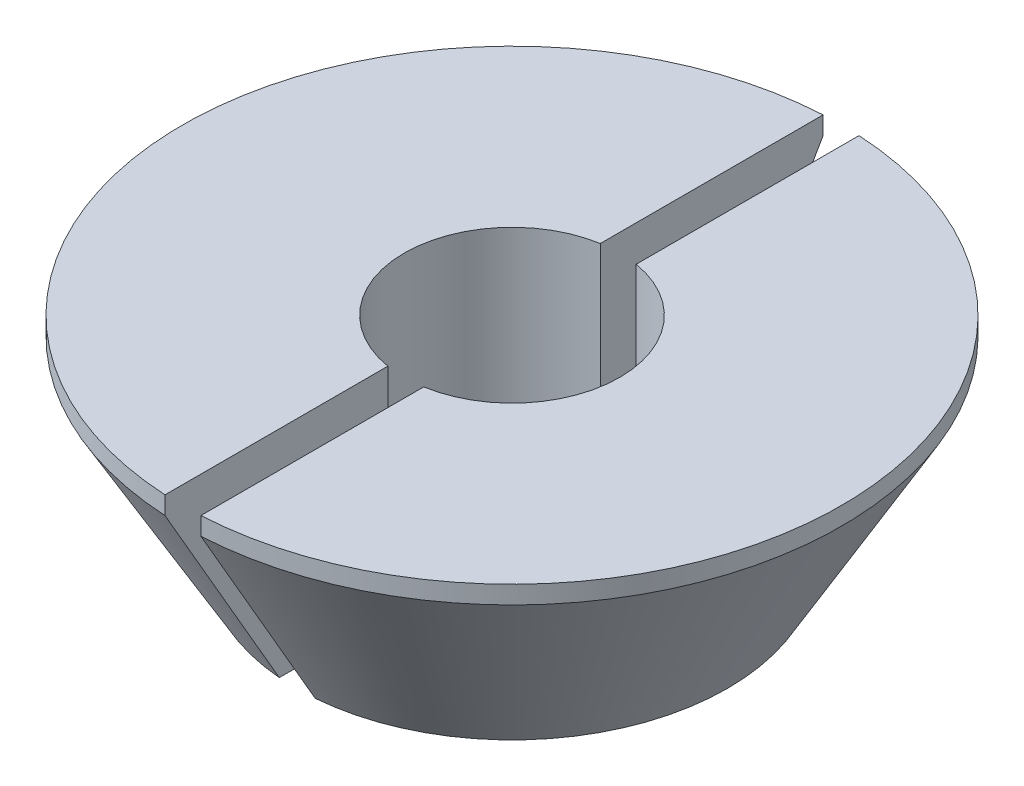
ISO-10303-21;
HEADER;
FILE_DESCRIPTION(('STEP AP214'),'2;1');
FILE_NAME('part.step','',(''),(''),'','','');
FILE_SCHEMA(('AUTOMOTIVE_DESIGN { 1 0 10303 214 1 1 1 1 }'));
ENDSEC;
DATA;
#1=APPLICATION_CONTEXT('core data for automotive mechanical design processes');
#2=APPLICATION_PROTOCOL_DEFINITION('international standard','automotive_design',2000,#1);
#3=PRODUCT_CONTEXT('',#1,'mechanical');
#4=PRODUCT('Part','Part','',(#3));
#5=PRODUCT_RELATED_PRODUCT_CATEGORY('part','',(#4));
#6=PRODUCT_DEFINITION_FORMATION('','',#4);
#7=PRODUCT_DEFINITION_CONTEXT('part definition',#1,'design');
#8=PRODUCT_DEFINITION('design','',#6,#7);
#9=PRODUCT_DEFINITION_SHAPE('','',#8);
#10=(LENGTH_UNIT() NAMED_UNIT(*) SI_UNIT(.MILLI.,.METRE.));
#11=(NAMED_UNIT(*) PLANE_ANGLE_UNIT() SI_UNIT($,.RADIAN.));
#12=(NAMED_UNIT(*) SI_UNIT($,.STERADIAN.) SOLID_ANGLE_UNIT());
#13=UNCERTAINTY_MEASURE_WITH_UNIT(LENGTH_MEASURE(1.E-05),#10,'distance_accuracy_value','');
#14=(GEOMETRIC_REPRESENTATION_CONTEXT(3) GLOBAL_UNCERTAINTY_ASSIGNED_CONTEXT((#13)) GLOBAL_UNIT_ASSIGNED_CONTEXT((#10,
#11,#12)) REPRESENTATION_CONTEXT('',''));
#15=CARTESIAN_POINT('',(0.,0.,0.));
#16=DIRECTION('',(0.,0.,1.));
#17=DIRECTION('',(1.,0.,0.));
#18=AXIS2_PLACEMENT_3D('',#15,#16,#17);
#19=CARTESIAN_POINT('',(0.,0.,0.));
#20=DIRECTION('',(0.,-1.,0.));
#21=DIRECTION('',(0.,0.,-1.));
#22=AXIS2_PLACEMENT_3D('',#19,#20,#21);
#23=CYLINDRICAL_SURFACE('',#22,1.5);
#24=DIRECTION('',(0.,-1.,0.));
#25=VECTOR('',#24,1.);
#26=CARTESIAN_POINT('',(-0.25,0.,-1.4790199457749));
#27=LINE('',#26,#25);
#28=CARTESIAN_POINT('',(-0.25,3.,-1.4790199457749));
#29=VERTEX_POINT('',#28);
#30=CARTESIAN_POINT('',(-0.25,0.,-1.4790199457749));
#31=VERTEX_POINT('',#30);
#32=EDGE_CURVE('E137',#29,#31,#27,.T.);
#33=ORIENTED_EDGE('',*,*,#32,.F.);
#34=CARTESIAN_POINT('',(0.,3.,0.));
#35=DIRECTION('',(0.,-1.,0.));
#36=DIRECTION('',(0.,0.,-1.));
#37=AXIS2_PLACEMENT_3D('',#34,#35,#36);
#38=CIRCLE('',#37,1.5);
#39=CARTESIAN_POINT('',(-0.25,3.,1.4790199457749));
#40=VERTEX_POINT('',#39);
#41=EDGE_CURVE('E58',#40,#29,#38,.T.);
#42=ORIENTED_EDGE('',*,*,#41,.F.);
#43=DIRECTION('',(0.,-1.,0.));
#44=VECTOR('',#43,1.);
#45=CARTESIAN_POINT('',(-0.25,0.,1.4790199457749));
#46=LINE('',#45,#44);
#47=CARTESIAN_POINT('',(-0.25,0.,1.4790199457749));
#48=VERTEX_POINT('',#47);
#49=EDGE_CURVE('E103',#48,#40,#46,.F.);
#50=ORIENTED_EDGE('',*,*,#49,.F.);
#51=CARTESIAN_POINT('',(0.,0.,0.));
#52=DIRECTION('',(0.,-1.,0.));
#53=DIRECTION('',(0.,0.,-1.));
#54=AXIS2_PLACEMENT_3D('',#51,#52,#53);
#55=CIRCLE('',#54,1.5);
#56=EDGE_CURVE('E125',#48,#31,#55,.T.);
#57=ORIENTED_EDGE('',*,*,#56,.T.);
#58=EDGE_LOOP('',(#33,#42,#50,#57));
#59=FACE_BOUND('',#58,.T.);
#60=ADVANCED_FACE('F55',(#59),#23,.F.);
#61=CARTESIAN_POINT('',(1.5,0.,0.));
#62=DIRECTION('',(0.,-1.,0.));
#63=DIRECTION('',(0.,0.,-1.));
#64=AXIS2_PLACEMENT_3D('',#61,#62,#63);
#65=PLANE('',#64);
#66=DIRECTION('',(0.,0.,1.));
#67=VECTOR('',#66,1.);
#68=CARTESIAN_POINT('',(-0.25,0.,5.));
#69=LINE('',#68,#67);
#70=CARTESIAN_POINT('',(-0.25,0.,2.98956518577535));
#71=VERTEX_POINT('',#70);
#72=EDGE_CURVE('E124',#48,#71,#69,.T.);
#73=ORIENTED_EDGE('',*,*,#72,.T.);
#74=CARTESIAN_POINT('',(0.,0.,0.));
#75=DIRECTION('',(0.,-1.,0.));
#76=DIRECTION('',(0.,0.,-1.));
#77=AXIS2_PLACEMENT_3D('',#74,#75,#76);
#78=CIRCLE('',#77,3.);
#79=CARTESIAN_POINT('',(-0.25,0.,-2.98956518577535));
#80=VERTEX_POINT('',#79);
#81=EDGE_CURVE('E121',#71,#80,#78,.T.);
#82=ORIENTED_EDGE('',*,*,#81,.T.);
#83=EDGE_CURVE('E118',#80,#31,#69,.T.);
#84=ORIENTED_EDGE('',*,*,#83,.T.);
#85=ORIENTED_EDGE('',*,*,#56,.F.);
#86=EDGE_LOOP('',(#73,#82,#84,#85));
#87=FACE_BOUND('',#86,.T.);
#88=ADVANCED_FACE('F152',(#87),#65,.T.);
#89=CARTESIAN_POINT('',(0.,0.,0.));
#90=DIRECTION('',(0.,1.,0.));
#91=DIRECTION('',(0.,0.,1.));
#92=AXIS2_PLACEMENT_3D('',#89,#90,#91);
#93=CONICAL_SURFACE('',#92,3.,0.523598775598296);
#94=CARTESIAN_POINT('',(-0.25,2.7507,4.58130124994628));
#95=CARTESIAN_POINT('',(-0.25,2.30903869331619,4.32591351485421));
#96=CARTESIAN_POINT('',(-0.25,1.8673922894135,4.07050000695337));
#97=CARTESIAN_POINT('',(-0.25,0.984189530915597,3.55949636803113));
#98=CARTESIAN_POINT('',(-0.25,0.542633178364574,3.303906233477));
#99=CARTESIAN_POINT('',(-0.25,-0.339622352568822,2.79283371340549));
#100=CARTESIAN_POINT('',(-0.25,-0.780321793608892,2.53735178175403));
#101=CARTESIAN_POINT('',(-0.25,-1.44105218951567,2.15358843954454));
#102=CARTESIAN_POINT('',(-0.25,-1.66124069362154,2.02557832036211));
#103=CARTESIAN_POINT('',(-0.25,-2.10143392140064,1.76924257975637));
#104=CARTESIAN_POINT('',(-0.25,-2.32143864525454,1.64091695864369));
#105=CARTESIAN_POINT('',(-0.25,-2.65109607715835,1.44800209859304));
#106=CARTESIAN_POINT('',(-0.25,-2.76088635913062,1.38364801701553));
#107=CARTESIAN_POINT('',(-0.25,-2.9803300633418,1.25469890985087));
#108=CARTESIAN_POINT('',(-0.25,-3.08998348124931,1.19010387688395));
#109=CARTESIAN_POINT('',(-0.25,-3.30913740964915,1.06048997752394));
#110=CARTESIAN_POINT('',(-0.25,-3.41863777119443,0.995470859239246));
#111=CARTESIAN_POINT('',(-0.25,-3.63724384345891,0.864790769509887));
#112=CARTESIAN_POINT('',(-0.25,-3.74634958743458,0.799129853965106));
#113=CARTESIAN_POINT('',(-0.25,-3.90939537672968,0.699661282365487));
#114=CARTESIAN_POINT('',(-0.25,-3.96363523834076,0.666346360197192));
#115=CARTESIAN_POINT('',(-0.25,-4.0718087021568,0.59919612339929));
#116=CARTESIAN_POINT('',(-0.25,-4.12574223386925,0.565360695145046));
#117=CARTESIAN_POINT('',(-0.25,-4.23306950973418,0.496884439905926));
#118=CARTESIAN_POINT('',(-0.25,-4.28646347218791,0.462243959019911));
#119=CARTESIAN_POINT('',(-0.25,-4.36579074139948,0.409159174477316));
#120=CARTESIAN_POINT('',(-0.25,-4.39210140763236,0.391280087003259));
#121=CARTESIAN_POINT('',(-0.25,-4.44434320604288,0.354977478512779));
#122=CARTESIAN_POINT('',(-0.25,-4.47027438553483,0.336554026247422));
#123=CARTESIAN_POINT('',(-0.25,-4.52266837565916,0.298062661536672));
#124=CARTESIAN_POINT('',(-0.25,-4.54910423855885,0.277958058949051));
#125=CARTESIAN_POINT('',(-0.25,-4.60084873672922,0.236317530814225));
#126=CARTESIAN_POINT('',(-0.25,-4.62615798168837,0.214782395545784));
#127=CARTESIAN_POINT('',(-0.25,-4.66308993754925,0.179748160310451));
#128=CARTESIAN_POINT('',(-0.25,-4.67559093480906,0.167185106727955));
#129=CARTESIAN_POINT('',(-0.25,-4.69943002381768,0.14096339830112));
#130=CARTESIAN_POINT('',(-0.25,-4.71076842610208,0.127305037765532));
#131=CARTESIAN_POINT('',(-0.25,-4.72780013017659,0.10340132686332));
#132=CARTESIAN_POINT('',(-0.25,-4.734095561821,0.0935927311169427));
#133=CARTESIAN_POINT('',(-0.25,-4.74527172181694,0.0731955570619789));
#134=CARTESIAN_POINT('',(-0.25,-4.75015585915936,0.0626089370746298));
#135=CARTESIAN_POINT('',(-0.25,-4.75685048371114,0.0434990481810949));
#136=CARTESIAN_POINT('',(-0.25,-4.7591280685593,0.0351433128796544));
#137=CARTESIAN_POINT('',(-0.25,-4.76224238659338,0.0181693372238074));
#138=CARTESIAN_POINT('',(-0.25,-4.76308134868023,0.00955152403865495));
#139=CARTESIAN_POINT('',(-0.25,-4.76319226700787,-0.00771739890612949));
#140=CARTESIAN_POINT('',(-0.25,-4.76246010259888,-0.0163685366759026));
#141=CARTESIAN_POINT('',(-0.25,-4.7595362658046,-0.0334205126405208));
#142=CARTESIAN_POINT('',(-0.25,-4.75734267641434,-0.041821006915605));
#143=CARTESIAN_POINT('',(-0.25,-4.7505019831396,-0.0619592304748283));
#144=CARTESIAN_POINT('',(-0.25,-4.74519163524888,-0.0734665087299003));
#145=CARTESIAN_POINT('',(-0.25,-4.73293371033722,-0.0955740929141563));
#146=CARTESIAN_POINT('',(-0.25,-4.7259802096446,-0.106170923597352));
#147=CARTESIAN_POINT('',(-0.25,-4.7070387196351,-0.13209112577422));
#148=CARTESIAN_POINT('',(-0.25,-4.69435326661881,-0.146894439765308));
#149=CARTESIAN_POINT('',(-0.25,-4.66769025736414,-0.175305480658226));
#150=CARTESIAN_POINT('',(-0.25,-4.65370927634657,-0.188909841753358));
#151=CARTESIAN_POINT('',(-0.25,-4.62489057044058,-0.215375053317189));
#152=CARTESIAN_POINT('',(-0.25,-4.6100476605207,-0.228230210970388));
#153=CARTESIAN_POINT('',(-0.25,-4.5798908605948,-0.253324488807357));
#154=CARTESIAN_POINT('',(-0.25,-4.56457765032898,-0.265564436365865));
#155=CARTESIAN_POINT('',(-0.25,-4.51251565994685,-0.306031272523836));
#156=CARTESIAN_POINT('',(-0.25,-4.47501976381492,-0.333291260895387));
#157=CARTESIAN_POINT('',(-0.25,-4.39916552518171,-0.386589970874721));
#158=CARTESIAN_POINT('',(-0.25,-4.36080677638868,-0.412628098549821));
#159=CARTESIAN_POINT('',(-0.25,-4.28352722011166,-0.463994605359522));
#160=CARTESIAN_POINT('',(-0.25,-4.24460560273193,-0.489321766313766));
#161=CARTESIAN_POINT('',(-0.25,-4.16645921413618,-0.539482078693726));
#162=CARTESIAN_POINT('',(-0.25,-4.12723450998449,-0.564315335292297));
#163=CARTESIAN_POINT('',(-0.25,-4.00957797274825,-0.638118082618644));
#164=CARTESIAN_POINT('',(-0.25,-3.93084104610306,-0.686600520165436));
#165=CARTESIAN_POINT('',(-0.25,-3.77301865873246,-0.782836710303956));
#166=CARTESIAN_POINT('',(-0.25,-3.69393355473172,-0.830591052041457));
#167=CARTESIAN_POINT('',(-0.25,-3.45673628352789,-0.972993869020176));
#168=CARTESIAN_POINT('',(-0.25,-3.29826269469418,-1.06703981886388));
#169=CARTESIAN_POINT('',(-0.25,-2.9809082473656,-1.25444465684626));
#170=CARTESIAN_POINT('',(-0.25,-2.82202738155739,-1.34780353252918));
#171=CARTESIAN_POINT('',(-0.25,-2.5039848431928,-1.5341703815286));
#172=CARTESIAN_POINT('',(-0.25,-2.34482309162637,-1.62717822012439));
#173=CARTESIAN_POINT('',(-0.25,-2.02636894955049,-1.8129670966563));
#174=CARTESIAN_POINT('',(-0.25,-1.86707655996801,-1.90574813618344));
#175=CARTESIAN_POINT('',(-0.25,-1.38881190555537,-2.18403061474365));
#176=CARTESIAN_POINT('',(-0.25,-1.06971500622448,-2.36931784128169));
#177=CARTESIAN_POINT('',(-0.25,-0.431397409255628,-2.73960581736539));
#178=CARTESIAN_POINT('',(-0.25,-0.112176727003876,-2.92460659345988));
#179=CARTESIAN_POINT('',(-0.25,0.419075912173664,-3.23231481563744));
#180=CARTESIAN_POINT('',(-0.25,0.631082614373474,-3.35506585857979));
#181=CARTESIAN_POINT('',(-0.25,1.05513072496129,-3.6005218601677));
#182=CARTESIAN_POINT('',(-0.25,1.2671721341636,-3.7232268174063));
#183=CARTESIAN_POINT('',(-0.25,1.69112181890542,-3.96851092030808));
#184=CARTESIAN_POINT('',(-0.25,1.90303007906541,-4.09109009255381));
#185=CARTESIAN_POINT('',(-0.25,2.32685695096556,-4.33621661921705));
#186=CARTESIAN_POINT('',(-0.25,2.53877556223929,-4.45876397444102));
#187=CARTESIAN_POINT('',(-0.25,2.7507,-4.58130124994628));
#188=B_SPLINE_CURVE_WITH_KNOTS('',3,(#94,#95,#96,#97,#98,#99,#100,#101,#102,#103,#104,#105,#106,
#107,#108,#109,#110,#111,#112,#113,#114,#115,#116,#117,#118,#119,#120,#121,#122,#123,#124,#125,
#126,#127,#128,#129,#130,#131,#132,#133,#134,#135,#136,#137,#138,#139,#140,#141,#142,#143,#144,
#145,#146,#147,#148,#149,#150,#151,#152,#153,#154,#155,#156,#157,#158,#159,#160,#161,#162,#163,
#164,#165,#166,#167,#168,#169,#170,#171,#172,#173,#174,#175,#176,#177,#178,#179,#180,#181,#182,
#183,#184,#185,#186,#187),.UNSPECIFIED.,.F.,.F.,(4,2,2,2,2,2,2,2,2,2,2,2,2,2,2,2,2,2,2,2,2,2,2,
2,2,2,2,2,2,2,2,2,2,2,2,2,2,2,2,2,2,2,2,2,2,2,4),(0.,1.53055165917343,3.0611348725171,
4.58933048642879,5.35341555866001,6.11749987886954,6.49928262842303,6.88107716867509,
7.26312403071503,7.64513790823927,7.83609813701725,8.02710066054484,8.21802253633585,
8.31345052052638,8.40886650363545,8.50848823555974,8.60805538325472,8.66118823306275,
8.71430685361641,8.7492011096657,8.7840103599953,8.80988829282017,8.8357260958483,
8.8616317474188,8.88757144746918,8.92537235517586,8.96331167447345,9.02163815450574,
9.08012347858901,9.13900699899976,9.19780908524264,9.33681963059197,9.47589706190675,
9.61519980798776,9.7544725660453,10.0318633451113,10.3090162839871,10.8618453748216,
11.4146844631641,11.9677176671428,12.5207469803313,13.6277188834659,14.7345811803759,
15.4695178602364,16.2044754006762,16.9388982175257,17.6733001265235),.UNSPECIFIED.);
#189=CARTESIAN_POINT('',(-0.25,2.75,4.58089650341088));
#190=VERTEX_POINT('',#189);
#191=EDGE_CURVE('E115',#190,#71,#188,.T.);
#192=ORIENTED_EDGE('',*,*,#191,.F.);
#193=CARTESIAN_POINT('',(0.,2.75,0.));
#194=DIRECTION('',(0.,-1.,0.));
#195=DIRECTION('',(0.,0.,-1.));
#196=AXIS2_PLACEMENT_3D('',#193,#194,#195);
#197=CIRCLE('',#196,4.58771324027146);
#198=CARTESIAN_POINT('',(-0.25,2.75,-4.58089650341088));
#199=VERTEX_POINT('',#198);
#200=EDGE_CURVE('E114',#190,#199,#197,.T.);
#201=ORIENTED_EDGE('',*,*,#200,.T.);
#202=EDGE_CURVE('E138',#80,#199,#188,.T.);
#203=ORIENTED_EDGE('',*,*,#202,.F.);
#204=ORIENTED_EDGE('',*,*,#81,.F.);
#205=EDGE_LOOP('',(#192,#201,#203,#204));
#206=FACE_BOUND('',#205,.T.);
#207=ADVANCED_FACE('F140',(#206),#93,.T.);
#208=CARTESIAN_POINT('',(0.,0.,0.));
#209=DIRECTION('',(0.,-1.,0.));
#210=DIRECTION('',(0.,0.,-1.));
#211=AXIS2_PLACEMENT_3D('',#208,#209,#210);
#212=CYLINDRICAL_SURFACE('',#211,4.58771324027146);
#213=DIRECTION('',(0.,-1.,0.));
#214=VECTOR('',#213,1.);
#215=CARTESIAN_POINT('',(-0.25,0.,-4.58089650341088));
#216=LINE('',#215,#214);
#217=CARTESIAN_POINT('',(-0.25,3.,-4.58089650341088));
#218=VERTEX_POINT('',#217);
#219=EDGE_CURVE('E63',#199,#218,#216,.F.);
#220=ORIENTED_EDGE('',*,*,#219,.F.);
#221=ORIENTED_EDGE('',*,*,#200,.F.);
#222=DIRECTION('',(0.,-1.,0.));
#223=VECTOR('',#222,1.);
#224=CARTESIAN_POINT('',(-0.25,0.,4.58089650341088));
#225=LINE('',#224,#223);
#226=CARTESIAN_POINT('',(-0.25,3.,4.58089650341088));
#227=VERTEX_POINT('',#226);
#228=EDGE_CURVE('E100',#227,#190,#225,.T.);
#229=ORIENTED_EDGE('',*,*,#228,.F.);
#230=CARTESIAN_POINT('',(0.,3.,0.));
#231=DIRECTION('',(0.,-1.,0.));
#232=DIRECTION('',(0.,0.,-1.));
#233=AXIS2_PLACEMENT_3D('',#230,#231,#232);
#234=CIRCLE('',#233,4.58771324027146);
#235=EDGE_CURVE('E112',#227,#218,#234,.T.);
#236=ORIENTED_EDGE('',*,*,#235,.T.);
#237=EDGE_LOOP('',(#220,#221,#229,#236));
#238=FACE_BOUND('',#237,.T.);
#239=ADVANCED_FACE('F111',(#238),#212,.T.);
#240=CARTESIAN_POINT('',(4.58771324027146,3.,0.));
#241=DIRECTION('',(0.,1.,0.));
#242=DIRECTION('',(0.,0.,1.));
#243=AXIS2_PLACEMENT_3D('',#240,#241,#242);
#244=PLANE('',#243);
#245=DIRECTION('',(0.,0.,1.));
#246=VECTOR('',#245,1.);
#247=CARTESIAN_POINT('',(-0.25,3.,0.));
#248=LINE('',#247,#246);
#249=EDGE_CURVE('E12',#218,#29,#248,.T.);
#250=ORIENTED_EDGE('',*,*,#249,.F.);
#251=ORIENTED_EDGE('',*,*,#235,.F.);
#252=EDGE_CURVE('E65',#40,#227,#248,.T.);
#253=ORIENTED_EDGE('',*,*,#252,.F.);
#254=ORIENTED_EDGE('',*,*,#41,.T.);
#255=EDGE_LOOP('',(#250,#251,#253,#254));
#256=FACE_BOUND('',#255,.T.);
#257=ADVANCED_FACE('F117',(#256),#244,.T.);
#258=CARTESIAN_POINT('',(-0.25,0.,5.));
#259=DIRECTION('',(-1.,0.,0.));
#260=DIRECTION('',(0.,0.,1.));
#261=AXIS2_PLACEMENT_3D('',#258,#259,#260);
#262=PLANE('',#261);
#263=ORIENTED_EDGE('',*,*,#49,.T.);
#264=ORIENTED_EDGE('',*,*,#252,.T.);
#265=ORIENTED_EDGE('',*,*,#228,.T.);
#266=ORIENTED_EDGE('',*,*,#191,.T.);
#267=ORIENTED_EDGE('',*,*,#72,.F.);
#268=EDGE_LOOP('',(#263,#264,#265,#266,#267));
#269=FACE_BOUND('',#268,.T.);
#270=ADVANCED_FACE('F99',(#269),#262,.F.);
#271=ORIENTED_EDGE('',*,*,#32,.T.);
#272=ORIENTED_EDGE('',*,*,#83,.F.);
#273=ORIENTED_EDGE('',*,*,#202,.T.);
#274=ORIENTED_EDGE('',*,*,#219,.T.);
#275=ORIENTED_EDGE('',*,*,#249,.T.);
#276=EDGE_LOOP('',(#271,#272,#273,#274,#275));
#277=FACE_BOUND('',#276,.T.);
#278=ADVANCED_FACE('F146',(#277),#262,.F.);
#279=CLOSED_SHELL('',(#60,#88,#207,#239,#257,#270,#278));
#280=MANIFOLD_SOLID_BREP('B2',#279);
#281=CARTESIAN_POINT('',(4.58771324027146,3.,0.));
#282=DIRECTION('',(0.,1.,0.));
#283=DIRECTION('',(0.,0.,1.));
#284=AXIS2_PLACEMENT_3D('',#281,#282,#283);
#285=PLANE('',#284);
#286=DIRECTION('',(0.,0.,-1.));
#287=VECTOR('',#286,1.);
#288=CARTESIAN_POINT('',(0.25,3.,0.));
#289=LINE('',#288,#287);
#290=CARTESIAN_POINT('',(0.25,3.,4.58089650341088));
#291=VERTEX_POINT('',#290);
#292=CARTESIAN_POINT('',(0.25,3.,1.4790199457749));
#293=VERTEX_POINT('',#292);
#294=EDGE_CURVE('E53',#291,#293,#289,.T.);
#295=ORIENTED_EDGE('',*,*,#294,.F.);
#296=CARTESIAN_POINT('',(0.,3.,0.));
#297=DIRECTION('',(0.,-1.,0.));
#298=DIRECTION('',(0.,0.,-1.));
#299=AXIS2_PLACEMENT_3D('',#296,#297,#298);
#300=CIRCLE('',#299,4.58771324027146);
#301=CARTESIAN_POINT('',(0.25,3.,-4.58089650341088));
#302=VERTEX_POINT('',#301);
#303=EDGE_CURVE('E282',#302,#291,#300,.T.);
#304=ORIENTED_EDGE('',*,*,#303,.F.);
#305=CARTESIAN_POINT('',(0.25,3.,-1.4790199457749));
#306=VERTEX_POINT('',#305);
#307=EDGE_CURVE('E225',#306,#302,#289,.T.);
#308=ORIENTED_EDGE('',*,*,#307,.F.);
#309=CARTESIAN_POINT('',(0.,3.,0.));
#310=DIRECTION('',(0.,-1.,0.));
#311=DIRECTION('',(0.,0.,-1.));
#312=AXIS2_PLACEMENT_3D('',#309,#310,#311);
#313=CIRCLE('',#312,1.5);
#314=EDGE_CURVE('E276',#306,#293,#313,.T.);
#315=ORIENTED_EDGE('',*,*,#314,.T.);
#316=EDGE_LOOP('',(#295,#304,#308,#315));
#317=FACE_BOUND('',#316,.T.);
#318=ADVANCED_FACE('F221',(#317),#285,.T.);
#319=CARTESIAN_POINT('',(0.,0.,0.));
#320=DIRECTION('',(0.,-1.,0.));
#321=DIRECTION('',(0.,0.,-1.));
#322=AXIS2_PLACEMENT_3D('',#319,#320,#321);
#323=CYLINDRICAL_SURFACE('',#322,4.58771324027146);
#324=DIRECTION('',(0.,-1.,0.));
#325=VECTOR('',#324,1.);
#326=CARTESIAN_POINT('',(0.25,0.,4.58089650341088));
#327=LINE('',#326,#325);
#328=CARTESIAN_POINT('',(0.25,2.75,4.58089650341088));
#329=VERTEX_POINT('',#328);
#330=EDGE_CURVE('E236',#329,#291,#327,.F.);
#331=ORIENTED_EDGE('',*,*,#330,.F.);
#332=CARTESIAN_POINT('',(0.,2.75,0.));
#333=DIRECTION('',(0.,-1.,0.));
#334=DIRECTION('',(0.,0.,-1.));
#335=AXIS2_PLACEMENT_3D('',#332,#333,#334);
#336=CIRCLE('',#335,4.58771324027146);
#337=CARTESIAN_POINT('',(0.25,2.75,-4.58089650341088));
#338=VERTEX_POINT('',#337);
#339=EDGE_CURVE('E285',#338,#329,#336,.T.);
#340=ORIENTED_EDGE('',*,*,#339,.F.);
#341=DIRECTION('',(0.,-1.,0.));
#342=VECTOR('',#341,1.);
#343=CARTESIAN_POINT('',(0.25,0.,-4.58089650341088));
#344=LINE('',#343,#342);
#345=EDGE_CURVE('E299',#302,#338,#344,.T.);
#346=ORIENTED_EDGE('',*,*,#345,.F.);
#347=ORIENTED_EDGE('',*,*,#303,.T.);
#348=EDGE_LOOP('',(#331,#340,#346,#347));
#349=FACE_BOUND('',#348,.T.);
#350=ADVANCED_FACE('F303',(#349),#323,.T.);
#351=CARTESIAN_POINT('',(0.,0.,0.));
#352=DIRECTION('',(0.,1.,0.));
#353=DIRECTION('',(0.,0.,1.));
#354=AXIS2_PLACEMENT_3D('',#351,#352,#353);
#355=CONICAL_SURFACE('',#354,3.,0.523598775598296);
#356=CARTESIAN_POINT('',(0.25,2.7507,-4.58130124994628));
#357=CARTESIAN_POINT('',(0.25,2.30903869331619,-4.32591351485421));
#358=CARTESIAN_POINT('',(0.25,1.8673922894135,-4.07050000695337));
#359=CARTESIAN_POINT('',(0.25,0.984189530915597,-3.55949636803113));
#360=CARTESIAN_POINT('',(0.25,0.542633178364574,-3.303906233477));
#361=CARTESIAN_POINT('',(0.25,-0.339622352568822,-2.79283371340549));
#362=CARTESIAN_POINT('',(0.25,-0.780321793608892,-2.53735178175403));
#363=CARTESIAN_POINT('',(0.25,-1.44105218951567,-2.15358843954454));
#364=CARTESIAN_POINT('',(0.25,-1.66124069362154,-2.02557832036211));
#365=CARTESIAN_POINT('',(0.25,-2.10143392140064,-1.76924257975637));
#366=CARTESIAN_POINT('',(0.25,-2.32143864525454,-1.64091695864369));
#367=CARTESIAN_POINT('',(0.25,-2.65109607715835,-1.44800209859304));
#368=CARTESIAN_POINT('',(0.25,-2.76088635913062,-1.38364801701553));
#369=CARTESIAN_POINT('',(0.25,-2.9803300633418,-1.25469890985087));
#370=CARTESIAN_POINT('',(0.25,-3.08998348124931,-1.19010387688395));
#371=CARTESIAN_POINT('',(0.25,-3.30913740964915,-1.06048997752394));
#372=CARTESIAN_POINT('',(0.25,-3.41863777119443,-0.995470859239246));
#373=CARTESIAN_POINT('',(0.25,-3.63724384345891,-0.864790769509887));
#374=CARTESIAN_POINT('',(0.25,-3.74634958743458,-0.799129853965106));
#375=CARTESIAN_POINT('',(0.25,-3.90939537672968,-0.699661282365487));
#376=CARTESIAN_POINT('',(0.25,-3.96363523834076,-0.666346360197192));
#377=CARTESIAN_POINT('',(0.25,-4.0718087021568,-0.59919612339929));
#378=CARTESIAN_POINT('',(0.25,-4.12574223386925,-0.565360695145046));
#379=CARTESIAN_POINT('',(0.25,-4.23306950973418,-0.496884439905926));
#380=CARTESIAN_POINT('',(0.25,-4.28646347218791,-0.462243959019911));
#381=CARTESIAN_POINT('',(0.25,-4.36579074139948,-0.409159174477316));
#382=CARTESIAN_POINT('',(0.25,-4.39210140763236,-0.391280087003259));
#383=CARTESIAN_POINT('',(0.25,-4.44434320604288,-0.354977478512779));
#384=CARTESIAN_POINT('',(0.25,-4.47027438553483,-0.336554026247422));
#385=CARTESIAN_POINT('',(0.25,-4.52266837565916,-0.298062661536672));
#386=CARTESIAN_POINT('',(0.25,-4.54910423855885,-0.277958058949051));
#387=CARTESIAN_POINT('',(0.25,-4.60084873672922,-0.236317530814225));
#388=CARTESIAN_POINT('',(0.25,-4.62615798168837,-0.214782395545784));
#389=CARTESIAN_POINT('',(0.25,-4.66308993754925,-0.179748160310451));
#390=CARTESIAN_POINT('',(0.25,-4.67559093480906,-0.167185106727955));
#391=CARTESIAN_POINT('',(0.25,-4.69943002381768,-0.14096339830112));
#392=CARTESIAN_POINT('',(0.25,-4.71076842610208,-0.127305037765532));
#393=CARTESIAN_POINT('',(0.25,-4.72780013017659,-0.10340132686332));
#394=CARTESIAN_POINT('',(0.25,-4.734095561821,-0.0935927311169427));
#395=CARTESIAN_POINT('',(0.25,-4.74527172181694,-0.0731955570619789));
#396=CARTESIAN_POINT('',(0.25,-4.75015585915936,-0.0626089370746298));
#397=CARTESIAN_POINT('',(0.25,-4.75685048371114,-0.0434990481810949));
#398=CARTESIAN_POINT('',(0.25,-4.7591280685593,-0.0351433128796544));
#399=CARTESIAN_POINT('',(0.25,-4.76224238659338,-0.0181693372238074));
#400=CARTESIAN_POINT('',(0.25,-4.76308134868023,-0.00955152403865495));
#401=CARTESIAN_POINT('',(0.25,-4.76319226700787,0.00771739890612949));
#402=CARTESIAN_POINT('',(0.25,-4.76246010259888,0.0163685366759026));
#403=CARTESIAN_POINT('',(0.25,-4.7595362658046,0.0334205126405208));
#404=CARTESIAN_POINT('',(0.25,-4.75734267641434,0.041821006915605));
#405=CARTESIAN_POINT('',(0.25,-4.7505019831396,0.0619592304748283));
#406=CARTESIAN_POINT('',(0.25,-4.74519163524888,0.0734665087299003));
#407=CARTESIAN_POINT('',(0.25,-4.73293371033722,0.0955740929141563));
#408=CARTESIAN_POINT('',(0.25,-4.7259802096446,0.106170923597352));
#409=CARTESIAN_POINT('',(0.25,-4.7070387196351,0.13209112577422));
#410=CARTESIAN_POINT('',(0.25,-4.69435326661881,0.146894439765308));
#411=CARTESIAN_POINT('',(0.25,-4.66769025736414,0.175305480658226));
#412=CARTESIAN_POINT('',(0.25,-4.65370927634657,0.188909841753358));
#413=CARTESIAN_POINT('',(0.25,-4.62489057044058,0.215375053317189));
#414=CARTESIAN_POINT('',(0.25,-4.6100476605207,0.228230210970388));
#415=CARTESIAN_POINT('',(0.25,-4.5798908605948,0.253324488807357));
#416=CARTESIAN_POINT('',(0.25,-4.56457765032898,0.265564436365865));
#417=CARTESIAN_POINT('',(0.25,-4.51251565994685,0.306031272523836));
#418=CARTESIAN_POINT('',(0.25,-4.47501976381492,0.333291260895387));
#419=CARTESIAN_POINT('',(0.25,-4.39916552518171,0.386589970874721));
#420=CARTESIAN_POINT('',(0.25,-4.36080677638868,0.412628098549821));
#421=CARTESIAN_POINT('',(0.25,-4.28352722011166,0.463994605359522));
#422=CARTESIAN_POINT('',(0.25,-4.24460560273193,0.489321766313766));
#423=CARTESIAN_POINT('',(0.25,-4.16645921413618,0.539482078693726));
#424=CARTESIAN_POINT('',(0.25,-4.12723450998449,0.564315335292297));
#425=CARTESIAN_POINT('',(0.25,-4.00957797274825,0.638118082618644));
#426=CARTESIAN_POINT('',(0.25,-3.93084104610306,0.686600520165436));
#427=CARTESIAN_POINT('',(0.25,-3.77301865873246,0.782836710303956));
#428=CARTESIAN_POINT('',(0.25,-3.69393355473172,0.830591052041457));
#429=CARTESIAN_POINT('',(0.25,-3.45673628352789,0.972993869020176));
#430=CARTESIAN_POINT('',(0.25,-3.29826269469418,1.06703981886388));
#431=CARTESIAN_POINT('',(0.25,-2.9809082473656,1.25444465684626));
#432=CARTESIAN_POINT('',(0.25,-2.82202738155739,1.34780353252918));
#433=CARTESIAN_POINT('',(0.25,-2.5039848431928,1.5341703815286));
#434=CARTESIAN_POINT('',(0.25,-2.34482309162637,1.62717822012439));
#435=CARTESIAN_POINT('',(0.25,-2.02636894955049,1.8129670966563));
#436=CARTESIAN_POINT('',(0.25,-1.86707655996801,1.90574813618344));
#437=CARTESIAN_POINT('',(0.25,-1.38881190555537,2.18403061474365));
#438=CARTESIAN_POINT('',(0.25,-1.06971500622448,2.36931784128169));
#439=CARTESIAN_POINT('',(0.25,-0.431397409255628,2.73960581736539));
#440=CARTESIAN_POINT('',(0.25,-0.112176727003876,2.92460659345988));
#441=CARTESIAN_POINT('',(0.25,0.419075912173664,3.23231481563744));
#442=CARTESIAN_POINT('',(0.25,0.631082614373474,3.35506585857979));
#443=CARTESIAN_POINT('',(0.25,1.05513072496129,3.6005218601677));
#444=CARTESIAN_POINT('',(0.25,1.2671721341636,3.7232268174063));
#445=CARTESIAN_POINT('',(0.25,1.69112181890542,3.96851092030808));
#446=CARTESIAN_POINT('',(0.25,1.90303007906541,4.09109009255381));
#447=CARTESIAN_POINT('',(0.25,2.32685695096556,4.33621661921705));
#448=CARTESIAN_POINT('',(0.25,2.53877556223929,4.45876397444102));
#449=CARTESIAN_POINT('',(0.25,2.7507,4.58130124994628));
#450=B_SPLINE_CURVE_WITH_KNOTS('',3,(#356,#357,#358,#359,#360,#361,#362,#363,#364,#365,#366,
#367,#368,#369,#370,#371,#372,#373,#374,#375,#376,#377,#378,#379,#380,#381,#382,#383,#384,#385,
#386,#387,#388,#389,#390,#391,#392,#393,#394,#395,#396,#397,#398,#399,#400,#401,#402,#403,#404,
#405,#406,#407,#408,#409,#410,#411,#412,#413,#414,#415,#416,#417,#418,#419,#420,#421,#422,#423,
#424,#425,#426,#427,#428,#429,#430,#431,#432,#433,#434,#435,#436,#437,#438,#439,#440,#441,#442,
#443,#444,#445,#446,#447,#448,#449),.UNSPECIFIED.,.F.,.F.,(4,2,2,2,2,2,2,2,2,2,2,2,2,2,2,2,2,2,
2,2,2,2,2,2,2,2,2,2,2,2,2,2,2,2,2,2,2,2,2,2,2,2,2,2,2,2,4),(0.,1.53055165917343,3.0611348725171,
4.58933048642879,5.35341555866001,6.11749987886954,6.49928262842303,6.88107716867509,
7.26312403071503,7.64513790823927,7.83609813701725,8.02710066054484,8.21802253633585,
8.31345052052638,8.40886650363545,8.50848823555974,8.60805538325472,8.66118823306275,
8.71430685361641,8.7492011096657,8.7840103599953,8.80988829282017,8.8357260958483,
8.8616317474188,8.88757144746918,8.92537235517586,8.96331167447345,9.02163815450574,
9.08012347858901,9.13900699899976,9.19780908524264,9.33681963059197,9.47589706190675,
9.61519980798776,9.7544725660453,10.0318633451113,10.3090162839871,10.8618453748216,
11.4146844631641,11.9677176671428,12.5207469803313,13.6277188834659,14.7345811803759,
15.4695178602364,16.2044754006762,16.9388982175257,17.6733001265235),.UNSPECIFIED.);
#451=CARTESIAN_POINT('',(0.25,0.,-2.98956518577535));
#452=VERTEX_POINT('',#451);
#453=EDGE_CURVE('E305',#338,#452,#450,.T.);
#454=ORIENTED_EDGE('',*,*,#453,.F.);
#455=ORIENTED_EDGE('',*,*,#339,.T.);
#456=CARTESIAN_POINT('',(0.25,0.,2.98956518577535));
#457=VERTEX_POINT('',#456);
#458=EDGE_CURVE('E311',#457,#329,#450,.T.);
#459=ORIENTED_EDGE('',*,*,#458,.F.);
#460=CARTESIAN_POINT('',(0.,0.,0.));
#461=DIRECTION('',(0.,-1.,0.));
#462=DIRECTION('',(0.,0.,-1.));
#463=AXIS2_PLACEMENT_3D('',#460,#461,#462);
#464=CIRCLE('',#463,3.);
#465=EDGE_CURVE('E292',#452,#457,#464,.T.);
#466=ORIENTED_EDGE('',*,*,#465,.F.);
#467=EDGE_LOOP('',(#454,#455,#459,#466));
#468=FACE_BOUND('',#467,.T.);
#469=ADVANCED_FACE('F321',(#468),#355,.T.);
#470=CARTESIAN_POINT('',(1.5,0.,0.));
#471=DIRECTION('',(0.,-1.,0.));
#472=DIRECTION('',(0.,0.,-1.));
#473=AXIS2_PLACEMENT_3D('',#470,#471,#472);
#474=PLANE('',#473);
#475=DIRECTION('',(0.,0.,-1.));
#476=VECTOR('',#475,1.);
#477=CARTESIAN_POINT('',(0.25,0.,5.));
#478=LINE('',#477,#476);
#479=CARTESIAN_POINT('',(0.25,0.,-1.4790199457749));
#480=VERTEX_POINT('',#479);
#481=EDGE_CURVE('E312',#480,#452,#478,.T.);
#482=ORIENTED_EDGE('',*,*,#481,.T.);
#483=ORIENTED_EDGE('',*,*,#465,.T.);
#484=CARTESIAN_POINT('',(0.25,0.,1.4790199457749));
#485=VERTEX_POINT('',#484);
#486=EDGE_CURVE('E306',#457,#485,#478,.T.);
#487=ORIENTED_EDGE('',*,*,#486,.T.);
#488=CARTESIAN_POINT('',(0.,0.,0.));
#489=DIRECTION('',(0.,-1.,0.));
#490=DIRECTION('',(0.,0.,-1.));
#491=AXIS2_PLACEMENT_3D('',#488,#489,#490);
#492=CIRCLE('',#491,1.5);
#493=EDGE_CURVE('E278',#480,#485,#492,.T.);
#494=ORIENTED_EDGE('',*,*,#493,.F.);
#495=EDGE_LOOP('',(#482,#483,#487,#494));
#496=FACE_BOUND('',#495,.T.);
#497=ADVANCED_FACE('F332',(#496),#474,.T.);
#498=CARTESIAN_POINT('',(0.,0.,0.));
#499=DIRECTION('',(0.,-1.,0.));
#500=DIRECTION('',(0.,0.,-1.));
#501=AXIS2_PLACEMENT_3D('',#498,#499,#500);
#502=CYLINDRICAL_SURFACE('',#501,1.5);
#503=DIRECTION('',(0.,-1.,0.));
#504=VECTOR('',#503,1.);
#505=CARTESIAN_POINT('',(0.25,0.,1.4790199457749));
#506=LINE('',#505,#504);
#507=EDGE_CURVE('E267',#293,#485,#506,.T.);
#508=ORIENTED_EDGE('',*,*,#507,.F.);
#509=ORIENTED_EDGE('',*,*,#314,.F.);
#510=DIRECTION('',(0.,-1.,0.));
#511=VECTOR('',#510,1.);
#512=CARTESIAN_POINT('',(0.25,0.,-1.4790199457749));
#513=LINE('',#512,#511);
#514=EDGE_CURVE('E244',#480,#306,#513,.F.);
#515=ORIENTED_EDGE('',*,*,#514,.F.);
#516=ORIENTED_EDGE('',*,*,#493,.T.);
#517=EDGE_LOOP('',(#508,#509,#515,#516));
#518=FACE_BOUND('',#517,.T.);
#519=ADVANCED_FACE('F223',(#518),#502,.F.);
#520=CARTESIAN_POINT('',(0.25,0.,5.));
#521=DIRECTION('',(1.,0.,0.));
#522=DIRECTION('',(0.,0.,-1.));
#523=AXIS2_PLACEMENT_3D('',#520,#521,#522);
#524=PLANE('',#523);
#525=ORIENTED_EDGE('',*,*,#514,.T.);
#526=ORIENTED_EDGE('',*,*,#307,.T.);
#527=ORIENTED_EDGE('',*,*,#345,.T.);
#528=ORIENTED_EDGE('',*,*,#453,.T.);
#529=ORIENTED_EDGE('',*,*,#481,.F.);
#530=EDGE_LOOP('',(#525,#526,#527,#528,#529));
#531=FACE_BOUND('',#530,.T.);
#532=ADVANCED_FACE('F298',(#531),#524,.F.);
#533=ORIENTED_EDGE('',*,*,#507,.T.);
#534=ORIENTED_EDGE('',*,*,#486,.F.);
#535=ORIENTED_EDGE('',*,*,#458,.T.);
#536=ORIENTED_EDGE('',*,*,#330,.T.);
#537=ORIENTED_EDGE('',*,*,#294,.T.);
#538=EDGE_LOOP('',(#533,#534,#535,#536,#537));
#539=FACE_BOUND('',#538,.T.);
#540=ADVANCED_FACE('F266',(#539),#524,.F.);
#541=CLOSED_SHELL('',(#318,#350,#469,#497,#519,#532,#540));
#542=MANIFOLD_SOLID_BREP('B6',#541);
#543=ADVANCED_BREP_SHAPE_REPRESENTATION('',(#18,#280,#542),#14);
#544=SHAPE_DEFINITION_REPRESENTATION(#9,#543);
ENDSEC;
END-ISO-10303-21;
